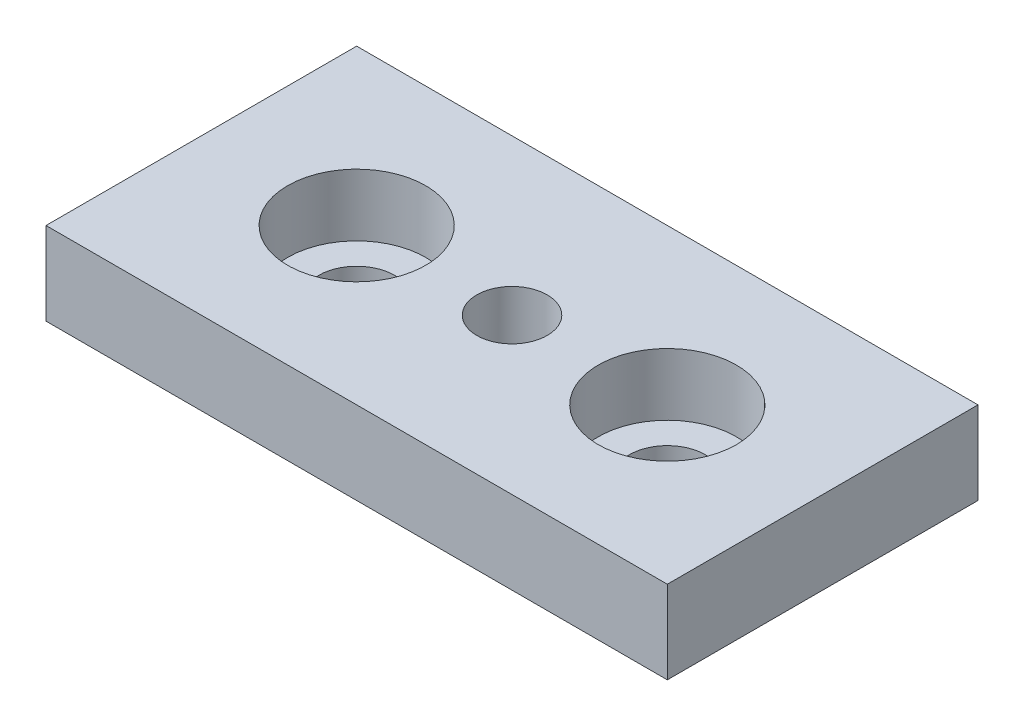
ISO-10303-21;
HEADER;
FILE_DESCRIPTION(('STEP AP214'),'2;1');
FILE_NAME('part.step','',(''),(''),'','','');
FILE_SCHEMA(('AUTOMOTIVE_DESIGN { 1 0 10303 214 1 1 1 1 }'));
ENDSEC;
DATA;
#1=APPLICATION_CONTEXT('core data for automotive mechanical design processes');
#2=APPLICATION_PROTOCOL_DEFINITION('international standard','automotive_design',2000,#1);
#3=PRODUCT_CONTEXT('',#1,'mechanical');
#4=PRODUCT('Part','Part','',(#3));
#5=PRODUCT_RELATED_PRODUCT_CATEGORY('part','',(#4));
#6=PRODUCT_DEFINITION_FORMATION('','',#4);
#7=PRODUCT_DEFINITION_CONTEXT('part definition',#1,'design');
#8=PRODUCT_DEFINITION('design','',#6,#7);
#9=PRODUCT_DEFINITION_SHAPE('','',#8);
#10=(LENGTH_UNIT() NAMED_UNIT(*) SI_UNIT(.MILLI.,.METRE.));
#11=(NAMED_UNIT(*) PLANE_ANGLE_UNIT() SI_UNIT($,.RADIAN.));
#12=(NAMED_UNIT(*) SI_UNIT($,.STERADIAN.) SOLID_ANGLE_UNIT());
#13=UNCERTAINTY_MEASURE_WITH_UNIT(LENGTH_MEASURE(1.E-05),#10,'distance_accuracy_value','');
#14=(GEOMETRIC_REPRESENTATION_CONTEXT(3) GLOBAL_UNCERTAINTY_ASSIGNED_CONTEXT((#13)) GLOBAL_UNIT_ASSIGNED_CONTEXT((#10,
#11,#12)) REPRESENTATION_CONTEXT('',''));
#15=CARTESIAN_POINT('',(0.,0.,0.));
#16=DIRECTION('',(0.,0.,1.));
#17=DIRECTION('',(1.,0.,0.));
#18=AXIS2_PLACEMENT_3D('',#15,#16,#17);
#19=CARTESIAN_POINT('',(45.,12.,22.5));
#20=DIRECTION('',(-1.,0.,0.));
#21=DIRECTION('',(0.,0.,1.));
#22=AXIS2_PLACEMENT_3D('',#19,#20,#21);
#23=PLANE('',#22);
#24=DIRECTION('',(0.,0.,-1.));
#25=VECTOR('',#24,1.);
#26=CARTESIAN_POINT('',(45.,0.,22.5));
#27=LINE('',#26,#25);
#28=CARTESIAN_POINT('',(45.,0.,22.5));
#29=VERTEX_POINT('',#28);
#30=CARTESIAN_POINT('',(45.,0.,-22.5));
#31=VERTEX_POINT('',#30);
#32=EDGE_CURVE('E100',#29,#31,#27,.T.);
#33=ORIENTED_EDGE('',*,*,#32,.T.);
#34=DIRECTION('',(0.,-1.,0.));
#35=VECTOR('',#34,1.);
#36=CARTESIAN_POINT('',(45.,12.,-22.5));
#37=LINE('',#36,#35);
#38=CARTESIAN_POINT('',(45.,12.,-22.5));
#39=VERTEX_POINT('',#38);
#40=EDGE_CURVE('E11',#39,#31,#37,.T.);
#41=ORIENTED_EDGE('',*,*,#40,.F.);
#42=DIRECTION('',(0.,0.,-1.));
#43=VECTOR('',#42,1.);
#44=CARTESIAN_POINT('',(45.,12.,22.5));
#45=LINE('',#44,#43);
#46=CARTESIAN_POINT('',(45.,12.,22.5));
#47=VERTEX_POINT('',#46);
#48=EDGE_CURVE('E88',#47,#39,#45,.T.);
#49=ORIENTED_EDGE('',*,*,#48,.F.);
#50=DIRECTION('',(0.,-1.,0.));
#51=VECTOR('',#50,1.);
#52=CARTESIAN_POINT('',(45.,12.,22.5));
#53=LINE('',#52,#51);
#54=EDGE_CURVE('E96',#47,#29,#53,.T.);
#55=ORIENTED_EDGE('',*,*,#54,.T.);
#56=EDGE_LOOP('',(#33,#41,#49,#55));
#57=FACE_BOUND('',#56,.T.);
#58=ADVANCED_FACE('F37',(#57),#23,.F.);
#59=CARTESIAN_POINT('',(-45.,12.,-22.5));
#60=DIRECTION('',(0.,0.,1.));
#61=DIRECTION('',(1.,0.,0.));
#62=AXIS2_PLACEMENT_3D('',#59,#60,#61);
#63=PLANE('',#62);
#64=DIRECTION('',(-1.,0.,0.));
#65=VECTOR('',#64,1.);
#66=CARTESIAN_POINT('',(-45.,0.,-22.5));
#67=LINE('',#66,#65);
#68=CARTESIAN_POINT('',(-45.,0.,-22.5));
#69=VERTEX_POINT('',#68);
#70=EDGE_CURVE('E92',#31,#69,#67,.T.);
#71=ORIENTED_EDGE('',*,*,#70,.T.);
#72=DIRECTION('',(0.,-1.,0.));
#73=VECTOR('',#72,1.);
#74=CARTESIAN_POINT('',(-45.,12.,-22.5));
#75=LINE('',#74,#73);
#76=CARTESIAN_POINT('',(-45.,12.,-22.5));
#77=VERTEX_POINT('',#76);
#78=EDGE_CURVE('E45',#77,#69,#75,.T.);
#79=ORIENTED_EDGE('',*,*,#78,.F.);
#80=DIRECTION('',(-1.,0.,0.));
#81=VECTOR('',#80,1.);
#82=CARTESIAN_POINT('',(-45.,12.,-22.5));
#83=LINE('',#82,#81);
#84=EDGE_CURVE('E83',#39,#77,#83,.T.);
#85=ORIENTED_EDGE('',*,*,#84,.F.);
#86=ORIENTED_EDGE('',*,*,#40,.T.);
#87=EDGE_LOOP('',(#71,#79,#85,#86));
#88=FACE_BOUND('',#87,.T.);
#89=ADVANCED_FACE('F91',(#88),#63,.F.);
#90=CARTESIAN_POINT('',(-45.,12.,22.5));
#91=DIRECTION('',(1.,0.,0.));
#92=DIRECTION('',(0.,0.,-1.));
#93=AXIS2_PLACEMENT_3D('',#90,#91,#92);
#94=PLANE('',#93);
#95=DIRECTION('',(0.,0.,1.));
#96=VECTOR('',#95,1.);
#97=CARTESIAN_POINT('',(-45.,0.,22.5));
#98=LINE('',#97,#96);
#99=CARTESIAN_POINT('',(-45.,0.,22.5));
#100=VERTEX_POINT('',#99);
#101=EDGE_CURVE('E70',#69,#100,#98,.T.);
#102=ORIENTED_EDGE('',*,*,#101,.T.);
#103=DIRECTION('',(0.,-1.,0.));
#104=VECTOR('',#103,1.);
#105=CARTESIAN_POINT('',(-45.,12.,22.5));
#106=LINE('',#105,#104);
#107=CARTESIAN_POINT('',(-45.,12.,22.5));
#108=VERTEX_POINT('',#107);
#109=EDGE_CURVE('E93',#108,#100,#106,.T.);
#110=ORIENTED_EDGE('',*,*,#109,.F.);
#111=DIRECTION('',(0.,0.,1.));
#112=VECTOR('',#111,1.);
#113=CARTESIAN_POINT('',(-45.,12.,22.5));
#114=LINE('',#113,#112);
#115=EDGE_CURVE('E86',#77,#108,#114,.T.);
#116=ORIENTED_EDGE('',*,*,#115,.F.);
#117=ORIENTED_EDGE('',*,*,#78,.T.);
#118=EDGE_LOOP('',(#102,#110,#116,#117));
#119=FACE_BOUND('',#118,.T.);
#120=ADVANCED_FACE('F94',(#119),#94,.F.);
#121=CARTESIAN_POINT('',(-45.,12.,22.5));
#122=DIRECTION('',(0.,0.,-1.));
#123=DIRECTION('',(-1.,0.,0.));
#124=AXIS2_PLACEMENT_3D('',#121,#122,#123);
#125=PLANE('',#124);
#126=DIRECTION('',(1.,0.,0.));
#127=VECTOR('',#126,1.);
#128=CARTESIAN_POINT('',(-45.,0.,22.5));
#129=LINE('',#128,#127);
#130=EDGE_CURVE('E76',#100,#29,#129,.T.);
#131=ORIENTED_EDGE('',*,*,#130,.T.);
#132=ORIENTED_EDGE('',*,*,#54,.F.);
#133=DIRECTION('',(1.,0.,0.));
#134=VECTOR('',#133,1.);
#135=CARTESIAN_POINT('',(-45.,12.,22.5));
#136=LINE('',#135,#134);
#137=EDGE_CURVE('E53',#108,#47,#136,.T.);
#138=ORIENTED_EDGE('',*,*,#137,.F.);
#139=ORIENTED_EDGE('',*,*,#109,.T.);
#140=EDGE_LOOP('',(#131,#132,#138,#139));
#141=FACE_BOUND('',#140,.T.);
#142=ADVANCED_FACE('F108',(#141),#125,.F.);
#143=CARTESIAN_POINT('',(0.,12.,0.));
#144=DIRECTION('',(0.,-1.,0.));
#145=DIRECTION('',(0.,0.,-1.));
#146=AXIS2_PLACEMENT_3D('',#143,#144,#145);
#147=PLANE('',#146);
#148=CARTESIAN_POINT('',(0.,12.,0.));
#149=DIRECTION('',(0.,1.,0.));
#150=DIRECTION('',(0.,0.,1.));
#151=AXIS2_PLACEMENT_3D('',#148,#149,#150);
#152=CIRCLE('',#151,5.1);
#153=CARTESIAN_POINT('',(0.,12.,5.1));
#154=VERTEX_POINT('',#153);
#155=EDGE_CURVE('E140',#154,#154,#152,.T.);
#156=ORIENTED_EDGE('',*,*,#155,.F.);
#157=EDGE_LOOP('',(#156));
#158=FACE_BOUND('',#157,.T.);
#159=CARTESIAN_POINT('',(22.5,12.,0.));
#160=DIRECTION('',(0.,-1.,0.));
#161=DIRECTION('',(1.,0.,0.));
#162=AXIS2_PLACEMENT_3D('',#159,#160,#161);
#163=CIRCLE('',#162,10.);
#164=CARTESIAN_POINT('',(32.5,12.,0.));
#165=VERTEX_POINT('',#164);
#166=EDGE_CURVE('E125',#165,#165,#163,.T.);
#167=ORIENTED_EDGE('',*,*,#166,.T.);
#168=EDGE_LOOP('',(#167));
#169=FACE_BOUND('',#168,.T.);
#170=CARTESIAN_POINT('',(-22.5,12.,0.));
#171=DIRECTION('',(0.,1.,0.));
#172=DIRECTION('',(-1.,0.,0.));
#173=AXIS2_PLACEMENT_3D('',#170,#171,#172);
#174=CIRCLE('',#173,10.);
#175=CARTESIAN_POINT('',(-32.5,12.,0.));
#176=VERTEX_POINT('',#175);
#177=EDGE_CURVE('E103',#176,#176,#174,.T.);
#178=ORIENTED_EDGE('',*,*,#177,.F.);
#179=EDGE_LOOP('',(#178));
#180=FACE_BOUND('',#179,.T.);
#181=ORIENTED_EDGE('',*,*,#48,.T.);
#182=ORIENTED_EDGE('',*,*,#84,.T.);
#183=ORIENTED_EDGE('',*,*,#115,.T.);
#184=ORIENTED_EDGE('',*,*,#137,.T.);
#185=EDGE_LOOP('',(#181,#182,#183,#184));
#186=FACE_BOUND('',#185,.T.);
#187=ADVANCED_FACE('F84',(#158,#169,#180,#186),#147,.F.);
#188=CARTESIAN_POINT('',(0.,0.,0.));
#189=DIRECTION('',(0.,-1.,0.));
#190=DIRECTION('',(0.,0.,-1.));
#191=AXIS2_PLACEMENT_3D('',#188,#189,#190);
#192=PLANE('',#191);
#193=CARTESIAN_POINT('',(0.,0.,0.));
#194=DIRECTION('',(0.,-1.,0.));
#195=DIRECTION('',(0.,0.,-1.));
#196=AXIS2_PLACEMENT_3D('',#193,#194,#195);
#197=CIRCLE('',#196,5.1);
#198=CARTESIAN_POINT('',(0.,0.,-5.1));
#199=VERTEX_POINT('',#198);
#200=EDGE_CURVE('E137',#199,#199,#197,.T.);
#201=ORIENTED_EDGE('',*,*,#200,.F.);
#202=EDGE_LOOP('',(#201));
#203=FACE_BOUND('',#202,.T.);
#204=CARTESIAN_POINT('',(22.5,0.,0.));
#205=DIRECTION('',(0.,-1.,0.));
#206=DIRECTION('',(1.,0.,0.));
#207=AXIS2_PLACEMENT_3D('',#204,#205,#206);
#208=CIRCLE('',#207,5.5);
#209=CARTESIAN_POINT('',(28.,0.,0.));
#210=VERTEX_POINT('',#209);
#211=EDGE_CURVE('E134',#210,#210,#208,.T.);
#212=ORIENTED_EDGE('',*,*,#211,.F.);
#213=EDGE_LOOP('',(#212));
#214=FACE_BOUND('',#213,.T.);
#215=CARTESIAN_POINT('',(-22.5,0.,0.));
#216=DIRECTION('',(0.,1.,0.));
#217=DIRECTION('',(-1.,0.,0.));
#218=AXIS2_PLACEMENT_3D('',#215,#216,#217);
#219=CIRCLE('',#218,5.5);
#220=CARTESIAN_POINT('',(-28.,0.,0.));
#221=VERTEX_POINT('',#220);
#222=EDGE_CURVE('E122',#221,#221,#219,.T.);
#223=ORIENTED_EDGE('',*,*,#222,.T.);
#224=EDGE_LOOP('',(#223));
#225=FACE_BOUND('',#224,.T.);
#226=ORIENTED_EDGE('',*,*,#32,.F.);
#227=ORIENTED_EDGE('',*,*,#130,.F.);
#228=ORIENTED_EDGE('',*,*,#101,.F.);
#229=ORIENTED_EDGE('',*,*,#70,.F.);
#230=EDGE_LOOP('',(#226,#227,#228,#229));
#231=FACE_BOUND('',#230,.T.);
#232=ADVANCED_FACE('F111',(#203,#214,#225,#231),#192,.T.);
#233=CARTESIAN_POINT('',(-22.5,12.,0.));
#234=DIRECTION('',(0.,1.,0.));
#235=DIRECTION('',(-1.,0.,0.));
#236=AXIS2_PLACEMENT_3D('',#233,#234,#235);
#237=CYLINDRICAL_SURFACE('',#236,10.);
#238=CARTESIAN_POINT('',(-22.5,3.,0.));
#239=DIRECTION('',(0.,1.,0.));
#240=DIRECTION('',(-1.,0.,0.));
#241=AXIS2_PLACEMENT_3D('',#238,#239,#240);
#242=CIRCLE('',#241,10.);
#243=CARTESIAN_POINT('',(-32.5,3.,0.));
#244=VERTEX_POINT('',#243);
#245=EDGE_CURVE('E116',#244,#244,#242,.T.);
#246=ORIENTED_EDGE('',*,*,#245,.F.);
#247=EDGE_LOOP('',(#246));
#248=FACE_BOUND('',#247,.T.);
#249=ORIENTED_EDGE('',*,*,#177,.T.);
#250=EDGE_LOOP('',(#249));
#251=FACE_BOUND('',#250,.T.);
#252=ADVANCED_FACE('F154',(#248,#251),#237,.F.);
#253=CARTESIAN_POINT('',(-32.5,3.,0.));
#254=DIRECTION('',(0.,-1.,0.));
#255=DIRECTION('',(1.,0.,0.));
#256=AXIS2_PLACEMENT_3D('',#253,#254,#255);
#257=PLANE('',#256);
#258=CARTESIAN_POINT('',(-22.5,3.,0.));
#259=DIRECTION('',(0.,1.,0.));
#260=DIRECTION('',(-1.,0.,0.));
#261=AXIS2_PLACEMENT_3D('',#258,#259,#260);
#262=CIRCLE('',#261,5.5);
#263=CARTESIAN_POINT('',(-28.,3.,0.));
#264=VERTEX_POINT('',#263);
#265=EDGE_CURVE('E119',#264,#264,#262,.T.);
#266=ORIENTED_EDGE('',*,*,#265,.F.);
#267=EDGE_LOOP('',(#266));
#268=FACE_BOUND('',#267,.T.);
#269=ORIENTED_EDGE('',*,*,#245,.T.);
#270=EDGE_LOOP('',(#269));
#271=FACE_BOUND('',#270,.T.);
#272=ADVANCED_FACE('F156',(#268,#271),#257,.F.);
#273=CARTESIAN_POINT('',(-22.5,12.,0.));
#274=DIRECTION('',(0.,1.,0.));
#275=DIRECTION('',(-1.,0.,0.));
#276=AXIS2_PLACEMENT_3D('',#273,#274,#275);
#277=CYLINDRICAL_SURFACE('',#276,5.5);
#278=ORIENTED_EDGE('',*,*,#222,.F.);
#279=EDGE_LOOP('',(#278));
#280=FACE_BOUND('',#279,.T.);
#281=ORIENTED_EDGE('',*,*,#265,.T.);
#282=EDGE_LOOP('',(#281));
#283=FACE_BOUND('',#282,.T.);
#284=ADVANCED_FACE('F163',(#280,#283),#277,.F.);
#285=CARTESIAN_POINT('',(22.5,12.,0.));
#286=DIRECTION('',(0.,1.,0.));
#287=DIRECTION('',(1.,0.,0.));
#288=AXIS2_PLACEMENT_3D('',#285,#286,#287);
#289=CYLINDRICAL_SURFACE('',#288,10.);
#290=CARTESIAN_POINT('',(22.5,3.,0.));
#291=DIRECTION('',(0.,-1.,0.));
#292=DIRECTION('',(1.,0.,0.));
#293=AXIS2_PLACEMENT_3D('',#290,#291,#292);
#294=CIRCLE('',#293,10.);
#295=CARTESIAN_POINT('',(32.5,3.,0.));
#296=VERTEX_POINT('',#295);
#297=EDGE_CURVE('E128',#296,#296,#294,.T.);
#298=ORIENTED_EDGE('',*,*,#297,.T.);
#299=EDGE_LOOP('',(#298));
#300=FACE_BOUND('',#299,.T.);
#301=ORIENTED_EDGE('',*,*,#166,.F.);
#302=EDGE_LOOP('',(#301));
#303=FACE_BOUND('',#302,.T.);
#304=ADVANCED_FACE('F219',(#300,#303),#289,.F.);
#305=CARTESIAN_POINT('',(32.5,3.,0.));
#306=DIRECTION('',(0.,-1.,0.));
#307=DIRECTION('',(-1.,0.,0.));
#308=AXIS2_PLACEMENT_3D('',#305,#306,#307);
#309=PLANE('',#308);
#310=CARTESIAN_POINT('',(22.5,3.,0.));
#311=DIRECTION('',(0.,-1.,0.));
#312=DIRECTION('',(1.,0.,0.));
#313=AXIS2_PLACEMENT_3D('',#310,#311,#312);
#314=CIRCLE('',#313,5.5);
#315=CARTESIAN_POINT('',(28.,3.,0.));
#316=VERTEX_POINT('',#315);
#317=EDGE_CURVE('E131',#316,#316,#314,.T.);
#318=ORIENTED_EDGE('',*,*,#317,.T.);
#319=EDGE_LOOP('',(#318));
#320=FACE_BOUND('',#319,.T.);
#321=ORIENTED_EDGE('',*,*,#297,.F.);
#322=EDGE_LOOP('',(#321));
#323=FACE_BOUND('',#322,.T.);
#324=ADVANCED_FACE('F212',(#320,#323),#309,.F.);
#325=CARTESIAN_POINT('',(22.5,12.,0.));
#326=DIRECTION('',(0.,1.,0.));
#327=DIRECTION('',(1.,0.,0.));
#328=AXIS2_PLACEMENT_3D('',#325,#326,#327);
#329=CYLINDRICAL_SURFACE('',#328,5.5);
#330=ORIENTED_EDGE('',*,*,#211,.T.);
#331=EDGE_LOOP('',(#330));
#332=FACE_BOUND('',#331,.T.);
#333=ORIENTED_EDGE('',*,*,#317,.F.);
#334=EDGE_LOOP('',(#333));
#335=FACE_BOUND('',#334,.T.);
#336=ADVANCED_FACE('F202',(#332,#335),#329,.F.);
#337=CARTESIAN_POINT('',(0.,12.,0.));
#338=DIRECTION('',(0.,1.,0.));
#339=DIRECTION('',(0.,0.,1.));
#340=AXIS2_PLACEMENT_3D('',#337,#338,#339);
#341=CYLINDRICAL_SURFACE('',#340,5.1);
#342=ORIENTED_EDGE('',*,*,#155,.T.);
#343=EDGE_LOOP('',(#342));
#344=FACE_BOUND('',#343,.T.);
#345=ORIENTED_EDGE('',*,*,#200,.T.);
#346=EDGE_LOOP('',(#345));
#347=FACE_BOUND('',#346,.T.);
#348=ADVANCED_FACE('F144',(#344,#347),#341,.F.);
#349=CLOSED_SHELL('',(#58,#89,#120,#142,#187,#232,#252,#272,#284,#304,#324,#336,#348));
#350=MANIFOLD_SOLID_BREP('B2',#349);
#351=ADVANCED_BREP_SHAPE_REPRESENTATION('',(#18,#350),#14);
#352=SHAPE_DEFINITION_REPRESENTATION(#9,#351);
ENDSEC;
END-ISO-10303-21;
